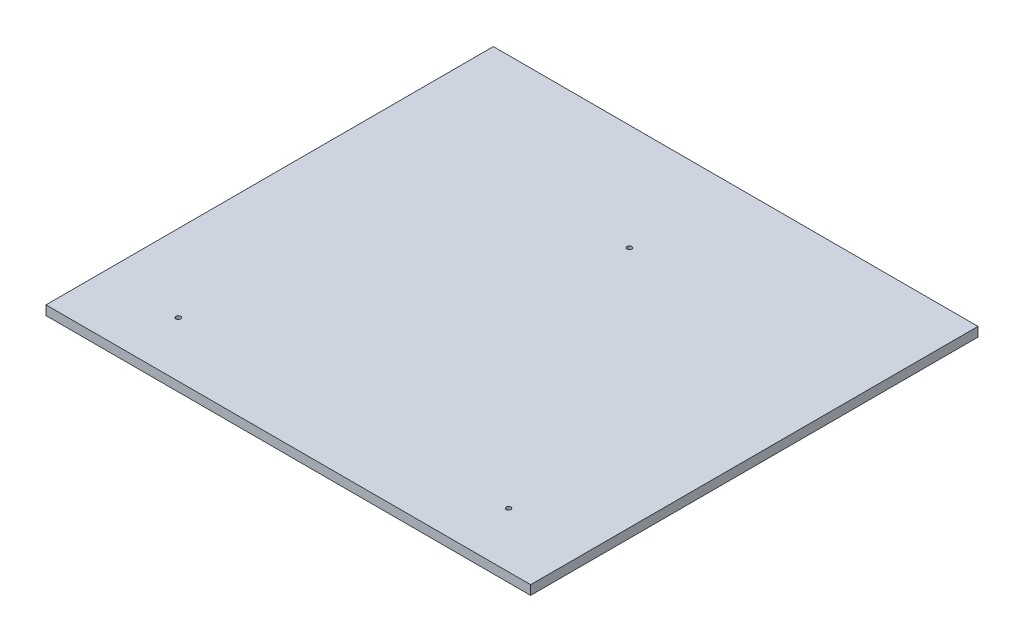
ISO-10303-21;
HEADER;
FILE_DESCRIPTION(('STEP AP214'),'2;1');
FILE_NAME('part.step','',(''),(''),'','','');
FILE_SCHEMA(('AUTOMOTIVE_DESIGN { 1 0 10303 214 1 1 1 1 }'));
ENDSEC;
DATA;
#1=APPLICATION_CONTEXT('core data for automotive mechanical design processes');
#2=APPLICATION_PROTOCOL_DEFINITION('international standard','automotive_design',2000,#1);
#3=PRODUCT_CONTEXT('',#1,'mechanical');
#4=PRODUCT('Part','Part','',(#3));
#5=PRODUCT_RELATED_PRODUCT_CATEGORY('part','',(#4));
#6=PRODUCT_DEFINITION_FORMATION('','',#4);
#7=PRODUCT_DEFINITION_CONTEXT('part definition',#1,'design');
#8=PRODUCT_DEFINITION('design','',#6,#7);
#9=PRODUCT_DEFINITION_SHAPE('','',#8);
#10=(LENGTH_UNIT() NAMED_UNIT(*) SI_UNIT(.MILLI.,.METRE.));
#11=(NAMED_UNIT(*) PLANE_ANGLE_UNIT() SI_UNIT($,.RADIAN.));
#12=(NAMED_UNIT(*) SI_UNIT($,.STERADIAN.) SOLID_ANGLE_UNIT());
#13=UNCERTAINTY_MEASURE_WITH_UNIT(LENGTH_MEASURE(1.E-05),#10,'distance_accuracy_value','');
#14=(GEOMETRIC_REPRESENTATION_CONTEXT(3) GLOBAL_UNCERTAINTY_ASSIGNED_CONTEXT((#13)) GLOBAL_UNIT_ASSIGNED_CONTEXT((#10,
#11,#12)) REPRESENTATION_CONTEXT('',''));
#15=CARTESIAN_POINT('',(0.,0.,0.));
#16=DIRECTION('',(0.,0.,1.));
#17=DIRECTION('',(1.,0.,0.));
#18=AXIS2_PLACEMENT_3D('',#15,#16,#17);
#19=CARTESIAN_POINT('',(0.,12.7,0.));
#20=DIRECTION('',(1.,0.,0.));
#21=DIRECTION('',(0.,0.,-1.));
#22=AXIS2_PLACEMENT_3D('',#19,#20,#21);
#23=PLANE('',#22);
#24=DIRECTION('',(0.,0.,1.));
#25=VECTOR('',#24,1.);
#26=CARTESIAN_POINT('',(0.,0.,0.));
#27=LINE('',#26,#25);
#28=CARTESIAN_POINT('',(0.,0.,-609.6));
#29=VERTEX_POINT('',#28);
#30=CARTESIAN_POINT('',(0.,0.,0.));
#31=VERTEX_POINT('',#30);
#32=EDGE_CURVE('E107',#29,#31,#27,.T.);
#33=ORIENTED_EDGE('',*,*,#32,.T.);
#34=DIRECTION('',(0.,-1.,0.));
#35=VECTOR('',#34,1.);
#36=CARTESIAN_POINT('',(0.,12.7,0.));
#37=LINE('',#36,#35);
#38=CARTESIAN_POINT('',(0.,12.7,0.));
#39=VERTEX_POINT('',#38);
#40=EDGE_CURVE('E11',#39,#31,#37,.T.);
#41=ORIENTED_EDGE('',*,*,#40,.F.);
#42=DIRECTION('',(0.,0.,1.));
#43=VECTOR('',#42,1.);
#44=CARTESIAN_POINT('',(0.,12.7,0.));
#45=LINE('',#44,#43);
#46=CARTESIAN_POINT('',(0.,12.7,-609.6));
#47=VERTEX_POINT('',#46);
#48=EDGE_CURVE('E91',#47,#39,#45,.T.);
#49=ORIENTED_EDGE('',*,*,#48,.F.);
#50=DIRECTION('',(0.,-1.,0.));
#51=VECTOR('',#50,1.);
#52=CARTESIAN_POINT('',(0.,12.7,-609.6));
#53=LINE('',#52,#51);
#54=EDGE_CURVE('E103',#47,#29,#53,.T.);
#55=ORIENTED_EDGE('',*,*,#54,.T.);
#56=EDGE_LOOP('',(#33,#41,#49,#55));
#57=FACE_BOUND('',#56,.T.);
#58=ADVANCED_FACE('F39',(#57),#23,.F.);
#59=CARTESIAN_POINT('',(0.,12.7,0.));
#60=DIRECTION('',(0.,0.,-1.));
#61=DIRECTION('',(-1.,0.,0.));
#62=AXIS2_PLACEMENT_3D('',#59,#60,#61);
#63=PLANE('',#62);
#64=DIRECTION('',(1.,0.,0.));
#65=VECTOR('',#64,1.);
#66=CARTESIAN_POINT('',(0.,0.,0.));
#67=LINE('',#66,#65);
#68=CARTESIAN_POINT('',(660.4,0.,0.));
#69=VERTEX_POINT('',#68);
#70=EDGE_CURVE('E96',#31,#69,#67,.T.);
#71=ORIENTED_EDGE('',*,*,#70,.T.);
#72=DIRECTION('',(0.,-1.,0.));
#73=VECTOR('',#72,1.);
#74=CARTESIAN_POINT('',(660.4,12.7,0.));
#75=LINE('',#74,#73);
#76=CARTESIAN_POINT('',(660.4,12.7,0.));
#77=VERTEX_POINT('',#76);
#78=EDGE_CURVE('E48',#77,#69,#75,.T.);
#79=ORIENTED_EDGE('',*,*,#78,.F.);
#80=DIRECTION('',(1.,0.,0.));
#81=VECTOR('',#80,1.);
#82=CARTESIAN_POINT('',(0.,12.7,0.));
#83=LINE('',#82,#81);
#84=EDGE_CURVE('E86',#39,#77,#83,.T.);
#85=ORIENTED_EDGE('',*,*,#84,.F.);
#86=ORIENTED_EDGE('',*,*,#40,.T.);
#87=EDGE_LOOP('',(#71,#79,#85,#86));
#88=FACE_BOUND('',#87,.T.);
#89=ADVANCED_FACE('F95',(#88),#63,.F.);
#90=CARTESIAN_POINT('',(660.4,12.7,0.));
#91=DIRECTION('',(-1.,0.,0.));
#92=DIRECTION('',(0.,0.,1.));
#93=AXIS2_PLACEMENT_3D('',#90,#91,#92);
#94=PLANE('',#93);
#95=DIRECTION('',(0.,0.,-1.));
#96=VECTOR('',#95,1.);
#97=CARTESIAN_POINT('',(660.4,0.,0.));
#98=LINE('',#97,#96);
#99=CARTESIAN_POINT('',(660.4,0.,-609.6));
#100=VERTEX_POINT('',#99);
#101=EDGE_CURVE('E73',#69,#100,#98,.T.);
#102=ORIENTED_EDGE('',*,*,#101,.T.);
#103=DIRECTION('',(0.,-1.,0.));
#104=VECTOR('',#103,1.);
#105=CARTESIAN_POINT('',(660.4,12.7,-609.6));
#106=LINE('',#105,#104);
#107=CARTESIAN_POINT('',(660.4,12.7,-609.6));
#108=VERTEX_POINT('',#107);
#109=EDGE_CURVE('E98',#108,#100,#106,.T.);
#110=ORIENTED_EDGE('',*,*,#109,.F.);
#111=DIRECTION('',(0.,0.,-1.));
#112=VECTOR('',#111,1.);
#113=CARTESIAN_POINT('',(660.4,12.7,0.));
#114=LINE('',#113,#112);
#115=EDGE_CURVE('E89',#77,#108,#114,.T.);
#116=ORIENTED_EDGE('',*,*,#115,.F.);
#117=ORIENTED_EDGE('',*,*,#78,.T.);
#118=EDGE_LOOP('',(#102,#110,#116,#117));
#119=FACE_BOUND('',#118,.T.);
#120=ADVANCED_FACE('F99',(#119),#94,.F.);
#121=CARTESIAN_POINT('',(0.,12.7,-609.6));
#122=DIRECTION('',(0.,0.,1.));
#123=DIRECTION('',(1.,0.,0.));
#124=AXIS2_PLACEMENT_3D('',#121,#122,#123);
#125=PLANE('',#124);
#126=DIRECTION('',(-1.,0.,0.));
#127=VECTOR('',#126,1.);
#128=CARTESIAN_POINT('',(0.,0.,-609.6));
#129=LINE('',#128,#127);
#130=EDGE_CURVE('E79',#100,#29,#129,.T.);
#131=ORIENTED_EDGE('',*,*,#130,.T.);
#132=ORIENTED_EDGE('',*,*,#54,.F.);
#133=DIRECTION('',(-1.,0.,0.));
#134=VECTOR('',#133,1.);
#135=CARTESIAN_POINT('',(0.,12.7,-609.6));
#136=LINE('',#135,#134);
#137=EDGE_CURVE('E56',#108,#47,#136,.T.);
#138=ORIENTED_EDGE('',*,*,#137,.F.);
#139=ORIENTED_EDGE('',*,*,#109,.T.);
#140=EDGE_LOOP('',(#131,#132,#138,#139));
#141=FACE_BOUND('',#140,.T.);
#142=ADVANCED_FACE('F121',(#141),#125,.F.);
#143=CARTESIAN_POINT('',(0.,12.7,0.));
#144=DIRECTION('',(0.,-1.,0.));
#145=DIRECTION('',(0.,0.,-1.));
#146=AXIS2_PLACEMENT_3D('',#143,#144,#145);
#147=PLANE('',#146);
#148=CARTESIAN_POINT('',(105.2,12.7,-75.1166466365201));
#149=DIRECTION('',(0.,1.,0.));
#150=DIRECTION('',(0.,0.,1.));
#151=AXIS2_PLACEMENT_3D('',#148,#149,#150);
#152=CIRCLE('',#151,3.17500000000001);
#153=CARTESIAN_POINT('',(105.2,12.7,-71.9416466365201));
#154=VERTEX_POINT('',#153);
#155=EDGE_CURVE('E144',#154,#154,#152,.T.);
#156=ORIENTED_EDGE('',*,*,#155,.F.);
#157=EDGE_LOOP('',(#156));
#158=FACE_BOUND('',#157,.T.);
#159=CARTESIAN_POINT('',(555.2,12.7,-75.1166466365201));
#160=DIRECTION('',(0.,1.,0.));
#161=DIRECTION('',(0.,0.,1.));
#162=AXIS2_PLACEMENT_3D('',#159,#160,#161);
#163=CIRCLE('',#162,3.1750000000002);
#164=CARTESIAN_POINT('',(555.2,12.7,-71.9416466365199));
#165=VERTEX_POINT('',#164);
#166=EDGE_CURVE('E136',#165,#165,#163,.T.);
#167=ORIENTED_EDGE('',*,*,#166,.F.);
#168=EDGE_LOOP('',(#167));
#169=FACE_BOUND('',#168,.T.);
#170=CARTESIAN_POINT('',(330.2,12.7,-464.828078339517));
#171=DIRECTION('',(0.,1.,0.));
#172=DIRECTION('',(0.,0.,1.));
#173=AXIS2_PLACEMENT_3D('',#170,#171,#172);
#174=CIRCLE('',#173,3.17499999999997);
#175=CARTESIAN_POINT('',(330.2,12.7,-461.653078339517));
#176=VERTEX_POINT('',#175);
#177=EDGE_CURVE('E128',#176,#176,#174,.T.);
#178=ORIENTED_EDGE('',*,*,#177,.F.);
#179=EDGE_LOOP('',(#178));
#180=FACE_BOUND('',#179,.T.);
#181=ORIENTED_EDGE('',*,*,#48,.T.);
#182=ORIENTED_EDGE('',*,*,#84,.T.);
#183=ORIENTED_EDGE('',*,*,#115,.T.);
#184=ORIENTED_EDGE('',*,*,#137,.T.);
#185=EDGE_LOOP('',(#181,#182,#183,#184));
#186=FACE_BOUND('',#185,.T.);
#187=ADVANCED_FACE('F87',(#158,#169,#180,#186),#147,.F.);
#188=CARTESIAN_POINT('',(0.,0.,0.));
#189=DIRECTION('',(0.,-1.,0.));
#190=DIRECTION('',(0.,0.,-1.));
#191=AXIS2_PLACEMENT_3D('',#188,#189,#190);
#192=PLANE('',#191);
#193=CARTESIAN_POINT('',(105.2,0.,-75.1166466365201));
#194=DIRECTION('',(0.,1.,0.));
#195=DIRECTION('',(0.,0.,1.));
#196=AXIS2_PLACEMENT_3D('',#193,#194,#195);
#197=CIRCLE('',#196,3.17500000000001);
#198=CARTESIAN_POINT('',(105.2,0.,-71.9416466365201));
#199=VERTEX_POINT('',#198);
#200=EDGE_CURVE('E111',#199,#199,#197,.T.);
#201=ORIENTED_EDGE('',*,*,#200,.T.);
#202=EDGE_LOOP('',(#201));
#203=FACE_BOUND('',#202,.T.);
#204=CARTESIAN_POINT('',(555.2,0.,-75.1166466365201));
#205=DIRECTION('',(0.,1.,0.));
#206=DIRECTION('',(0.,0.,1.));
#207=AXIS2_PLACEMENT_3D('',#204,#205,#206);
#208=CIRCLE('',#207,3.1750000000002);
#209=CARTESIAN_POINT('',(555.2,0.,-71.9416466365199));
#210=VERTEX_POINT('',#209);
#211=EDGE_CURVE('E140',#210,#210,#208,.T.);
#212=ORIENTED_EDGE('',*,*,#211,.T.);
#213=EDGE_LOOP('',(#212));
#214=FACE_BOUND('',#213,.T.);
#215=CARTESIAN_POINT('',(330.2,0.,-464.828078339517));
#216=DIRECTION('',(0.,1.,0.));
#217=DIRECTION('',(0.,0.,1.));
#218=AXIS2_PLACEMENT_3D('',#215,#216,#217);
#219=CIRCLE('',#218,3.17499999999997);
#220=CARTESIAN_POINT('',(330.2,0.,-461.653078339517));
#221=VERTEX_POINT('',#220);
#222=EDGE_CURVE('E132',#221,#221,#219,.T.);
#223=ORIENTED_EDGE('',*,*,#222,.T.);
#224=EDGE_LOOP('',(#223));
#225=FACE_BOUND('',#224,.T.);
#226=ORIENTED_EDGE('',*,*,#32,.F.);
#227=ORIENTED_EDGE('',*,*,#130,.F.);
#228=ORIENTED_EDGE('',*,*,#101,.F.);
#229=ORIENTED_EDGE('',*,*,#70,.F.);
#230=EDGE_LOOP('',(#226,#227,#228,#229));
#231=FACE_BOUND('',#230,.T.);
#232=ADVANCED_FACE('F124',(#203,#214,#225,#231),#192,.T.);
#233=CARTESIAN_POINT('',(330.2,0.,-464.828078339517));
#234=DIRECTION('',(0.,1.,0.));
#235=DIRECTION('',(0.,0.,1.));
#236=AXIS2_PLACEMENT_3D('',#233,#234,#235);
#237=CYLINDRICAL_SURFACE('',#236,3.17499999999997);
#238=ORIENTED_EDGE('',*,*,#222,.F.);
#239=EDGE_LOOP('',(#238));
#240=FACE_BOUND('',#239,.T.);
#241=ORIENTED_EDGE('',*,*,#177,.T.);
#242=EDGE_LOOP('',(#241));
#243=FACE_BOUND('',#242,.T.);
#244=ADVANCED_FACE('F168',(#240,#243),#237,.F.);
#245=CARTESIAN_POINT('',(555.2,0.,-75.1166466365201));
#246=DIRECTION('',(0.,1.,0.));
#247=DIRECTION('',(0.,0.,1.));
#248=AXIS2_PLACEMENT_3D('',#245,#246,#247);
#249=CYLINDRICAL_SURFACE('',#248,3.1750000000002);
#250=ORIENTED_EDGE('',*,*,#211,.F.);
#251=EDGE_LOOP('',(#250));
#252=FACE_BOUND('',#251,.T.);
#253=ORIENTED_EDGE('',*,*,#166,.T.);
#254=EDGE_LOOP('',(#253));
#255=FACE_BOUND('',#254,.T.);
#256=ADVANCED_FACE('F157',(#252,#255),#249,.F.);
#257=CARTESIAN_POINT('',(105.2,0.,-75.1166466365201));
#258=DIRECTION('',(0.,1.,0.));
#259=DIRECTION('',(0.,0.,1.));
#260=AXIS2_PLACEMENT_3D('',#257,#258,#259);
#261=CYLINDRICAL_SURFACE('',#260,3.17500000000001);
#262=ORIENTED_EDGE('',*,*,#200,.F.);
#263=EDGE_LOOP('',(#262));
#264=FACE_BOUND('',#263,.T.);
#265=ORIENTED_EDGE('',*,*,#155,.T.);
#266=EDGE_LOOP('',(#265));
#267=FACE_BOUND('',#266,.T.);
#268=ADVANCED_FACE('F154',(#264,#267),#261,.F.);
#269=CLOSED_SHELL('',(#58,#89,#120,#142,#187,#232,#244,#256,#268));
#270=MANIFOLD_SOLID_BREP('B2',#269);
#271=ADVANCED_BREP_SHAPE_REPRESENTATION('',(#18,#270),#14);
#272=SHAPE_DEFINITION_REPRESENTATION(#9,#271);
ENDSEC;
END-ISO-10303-21;
